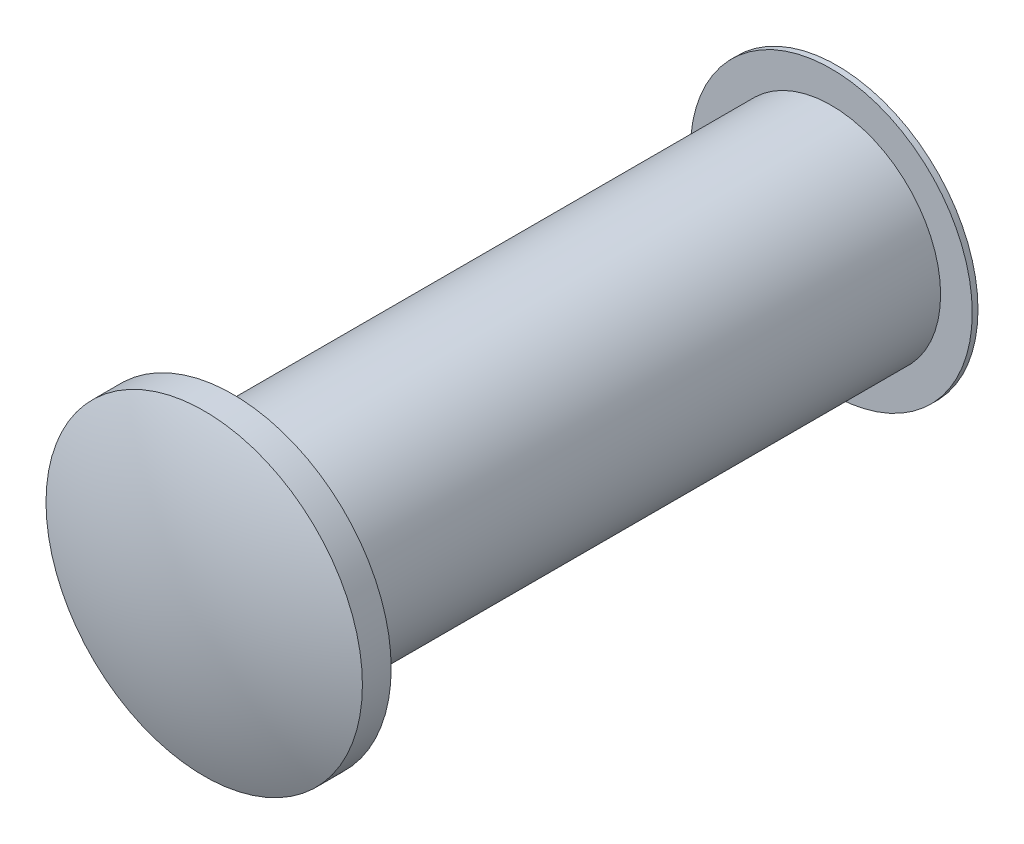
ISO-10303-21;
HEADER;
FILE_DESCRIPTION(('STEP AP214'),'2;1');
FILE_NAME('part.step','',(''),(''),'','','');
FILE_SCHEMA(('AUTOMOTIVE_DESIGN { 1 0 10303 214 1 1 1 1 }'));
ENDSEC;
DATA;
#1=APPLICATION_CONTEXT('core data for automotive mechanical design processes');
#2=APPLICATION_PROTOCOL_DEFINITION('international standard','automotive_design',2000,#1);
#3=PRODUCT_CONTEXT('',#1,'mechanical');
#4=PRODUCT('Part','Part','',(#3));
#5=PRODUCT_RELATED_PRODUCT_CATEGORY('part','',(#4));
#6=PRODUCT_DEFINITION_FORMATION('','',#4);
#7=PRODUCT_DEFINITION_CONTEXT('part definition',#1,'design');
#8=PRODUCT_DEFINITION('design','',#6,#7);
#9=PRODUCT_DEFINITION_SHAPE('','',#8);
#10=(LENGTH_UNIT() NAMED_UNIT(*) SI_UNIT(.MILLI.,.METRE.));
#11=(NAMED_UNIT(*) PLANE_ANGLE_UNIT() SI_UNIT($,.RADIAN.));
#12=(NAMED_UNIT(*) SI_UNIT($,.STERADIAN.) SOLID_ANGLE_UNIT());
#13=UNCERTAINTY_MEASURE_WITH_UNIT(LENGTH_MEASURE(1.E-05),#10,'distance_accuracy_value','');
#14=(GEOMETRIC_REPRESENTATION_CONTEXT(3) GLOBAL_UNCERTAINTY_ASSIGNED_CONTEXT((#13)) GLOBAL_UNIT_ASSIGNED_CONTEXT((#10,
#11,#12)) REPRESENTATION_CONTEXT('',''));
#15=CARTESIAN_POINT('',(0.,0.,0.));
#16=DIRECTION('',(0.,0.,1.));
#17=DIRECTION('',(1.,0.,0.));
#18=AXIS2_PLACEMENT_3D('',#15,#16,#17);
#19=CARTESIAN_POINT('',(0.,0.,5.2832));
#20=DIRECTION('',(0.,0.,-1.));
#21=DIRECTION('',(-1.,0.,0.));
#22=AXIS2_PLACEMENT_3D('',#19,#20,#21);
#23=CYLINDRICAL_SURFACE('',#22,0.9652);
#24=CARTESIAN_POINT('',(0.,0.,5.2832));
#25=DIRECTION('',(0.,0.,1.));
#26=DIRECTION('',(1.,0.,0.));
#27=AXIS2_PLACEMENT_3D('',#24,#25,#26);
#28=CIRCLE('',#27,0.9652);
#29=CARTESIAN_POINT('',(0.9652,0.,5.2832));
#30=VERTEX_POINT('',#29);
#31=EDGE_CURVE('E10',#30,#30,#28,.T.);
#32=ORIENTED_EDGE('',*,*,#31,.F.);
#33=EDGE_LOOP('',(#32));
#34=FACE_BOUND('',#33,.T.);
#35=CARTESIAN_POINT('',(0.,0.,0.));
#36=DIRECTION('',(0.,0.,1.));
#37=DIRECTION('',(1.,0.,0.));
#38=AXIS2_PLACEMENT_3D('',#35,#36,#37);
#39=CIRCLE('',#38,0.9652);
#40=CARTESIAN_POINT('',(0.9652,0.,0.));
#41=VERTEX_POINT('',#40);
#42=EDGE_CURVE('E56',#41,#41,#39,.T.);
#43=ORIENTED_EDGE('',*,*,#42,.T.);
#44=EDGE_LOOP('',(#43));
#45=FACE_BOUND('',#44,.T.);
#46=ADVANCED_FACE('F38',(#34,#45),#23,.T.);
#47=CARTESIAN_POINT('',(0.,0.,5.5372));
#48=DIRECTION('',(0.,0.,-1.));
#49=DIRECTION('',(-1.,0.,0.));
#50=AXIS2_PLACEMENT_3D('',#47,#48,#49);
#51=CYLINDRICAL_SURFACE('',#50,1.397);
#52=CARTESIAN_POINT('',(0.,0.,5.5372));
#53=DIRECTION('',(0.,0.,1.));
#54=DIRECTION('',(1.,0.,0.));
#55=AXIS2_PLACEMENT_3D('',#52,#53,#54);
#56=CIRCLE('',#55,1.397);
#57=CARTESIAN_POINT('',(1.397,0.,5.5372));
#58=VERTEX_POINT('',#57);
#59=EDGE_CURVE('E42',#58,#58,#56,.T.);
#60=ORIENTED_EDGE('',*,*,#59,.F.);
#61=EDGE_LOOP('',(#60));
#62=FACE_BOUND('',#61,.T.);
#63=CARTESIAN_POINT('',(0.,0.,5.2832));
#64=DIRECTION('',(0.,0.,1.));
#65=DIRECTION('',(1.,0.,0.));
#66=AXIS2_PLACEMENT_3D('',#63,#64,#65);
#67=CIRCLE('',#66,1.397);
#68=CARTESIAN_POINT('',(1.397,0.,5.2832));
#69=VERTEX_POINT('',#68);
#70=EDGE_CURVE('E53',#69,#69,#67,.T.);
#71=ORIENTED_EDGE('',*,*,#70,.T.);
#72=EDGE_LOOP('',(#71));
#73=FACE_BOUND('',#72,.T.);
#74=ADVANCED_FACE('F108',(#62,#73),#51,.T.);
#75=CARTESIAN_POINT('',(0.,0.,2.1844));
#76=DIRECTION('',(0.,0.,1.));
#77=DIRECTION('',(1.,0.,0.));
#78=AXIS2_PLACEMENT_3D('',#75,#76,#77);
#79=SPHERICAL_SURFACE('',#78,3.6322);
#80=ORIENTED_EDGE('',*,*,#59,.T.);
#81=EDGE_LOOP('',(#80));
#82=FACE_BOUND('',#81,.T.);
#83=ADVANCED_FACE('F40',(#82),#79,.T.);
#84=CARTESIAN_POINT('',(0.,0.,5.2832));
#85=DIRECTION('',(0.,0.,1.));
#86=DIRECTION('',(1.,0.,0.));
#87=AXIS2_PLACEMENT_3D('',#84,#85,#86);
#88=PLANE('',#87);
#89=ORIENTED_EDGE('',*,*,#31,.T.);
#90=EDGE_LOOP('',(#89));
#91=FACE_BOUND('',#90,.T.);
#92=ORIENTED_EDGE('',*,*,#70,.F.);
#93=EDGE_LOOP('',(#92));
#94=FACE_BOUND('',#93,.T.);
#95=ADVANCED_FACE('F104',(#91,#94),#88,.F.);
#96=CARTESIAN_POINT('',(0.,0.,-0.0507999999999999));
#97=DIRECTION('',(0.,0.,1.));
#98=DIRECTION('',(1.,0.,0.));
#99=AXIS2_PLACEMENT_3D('',#96,#97,#98);
#100=CYLINDRICAL_SURFACE('',#99,1.2446);
#101=CARTESIAN_POINT('',(0.,0.,-0.0507999999999999));
#102=DIRECTION('',(0.,0.,-1.));
#103=DIRECTION('',(-1.,0.,0.));
#104=AXIS2_PLACEMENT_3D('',#101,#102,#103);
#105=CIRCLE('',#104,1.2446);
#106=CARTESIAN_POINT('',(-1.2446,0.,-0.0507999999999999));
#107=VERTEX_POINT('',#106);
#108=EDGE_CURVE('E59',#107,#107,#105,.T.);
#109=ORIENTED_EDGE('',*,*,#108,.F.);
#110=EDGE_LOOP('',(#109));
#111=FACE_BOUND('',#110,.T.);
#112=CARTESIAN_POINT('',(0.,0.,0.));
#113=DIRECTION('',(0.,0.,-1.));
#114=DIRECTION('',(-1.,0.,0.));
#115=AXIS2_PLACEMENT_3D('',#112,#113,#114);
#116=CIRCLE('',#115,1.2446);
#117=CARTESIAN_POINT('',(-1.2446,0.,0.));
#118=VERTEX_POINT('',#117);
#119=EDGE_CURVE('E67',#118,#118,#116,.T.);
#120=ORIENTED_EDGE('',*,*,#119,.T.);
#121=EDGE_LOOP('',(#120));
#122=FACE_BOUND('',#121,.T.);
#123=ADVANCED_FACE('F96',(#111,#122),#100,.T.);
#124=CARTESIAN_POINT('',(0.,0.,-0.0507999999999999));
#125=DIRECTION('',(0.,0.,-1.));
#126=DIRECTION('',(-1.,0.,0.));
#127=AXIS2_PLACEMENT_3D('',#124,#125,#126);
#128=PLANE('',#127);
#129=CARTESIAN_POINT('',(0.,0.,-0.0507999999999999));
#130=DIRECTION('',(0.,0.,-1.));
#131=DIRECTION('',(-1.,0.,0.));
#132=AXIS2_PLACEMENT_3D('',#129,#130,#131);
#133=CIRCLE('',#132,0.592078561156017);
#134=CARTESIAN_POINT('',(-0.592078561156017,0.,-0.0507999999999999));
#135=VERTEX_POINT('',#134);
#136=EDGE_CURVE('E76',#135,#135,#133,.T.);
#137=ORIENTED_EDGE('',*,*,#136,.F.);
#138=EDGE_LOOP('',(#137));
#139=FACE_BOUND('',#138,.T.);
#140=ORIENTED_EDGE('',*,*,#108,.T.);
#141=EDGE_LOOP('',(#140));
#142=FACE_BOUND('',#141,.T.);
#143=ADVANCED_FACE('F94',(#139,#142),#128,.T.);
#144=CARTESIAN_POINT('',(0.,0.,0.));
#145=DIRECTION('',(0.,0.,-1.));
#146=DIRECTION('',(-1.,0.,0.));
#147=AXIS2_PLACEMENT_3D('',#144,#145,#146);
#148=PLANE('',#147);
#149=ORIENTED_EDGE('',*,*,#42,.F.);
#150=EDGE_LOOP('',(#149));
#151=FACE_BOUND('',#150,.T.);
#152=ORIENTED_EDGE('',*,*,#119,.F.);
#153=EDGE_LOOP('',(#152));
#154=FACE_BOUND('',#153,.T.);
#155=ADVANCED_FACE('F90',(#151,#154),#148,.F.);
#156=CARTESIAN_POINT('',(0.,0.,0.4572));
#157=DIRECTION('',(0.,0.,-1.));
#158=DIRECTION('',(-1.,0.,0.));
#159=AXIS2_PLACEMENT_3D('',#156,#157,#158);
#160=CYLINDRICAL_SURFACE('',#159,0.592078561156017);
#161=CARTESIAN_POINT('',(0.,0.,0.4572));
#162=DIRECTION('',(0.,0.,-1.));
#163=DIRECTION('',(-1.,0.,0.));
#164=AXIS2_PLACEMENT_3D('',#161,#162,#163);
#165=CIRCLE('',#164,0.592078561156017);
#166=CARTESIAN_POINT('',(-0.592078561156017,0.,0.4572));
#167=VERTEX_POINT('',#166);
#168=EDGE_CURVE('E74',#167,#167,#165,.T.);
#169=ORIENTED_EDGE('',*,*,#168,.F.);
#170=EDGE_LOOP('',(#169));
#171=FACE_BOUND('',#170,.T.);
#172=ORIENTED_EDGE('',*,*,#136,.T.);
#173=EDGE_LOOP('',(#172));
#174=FACE_BOUND('',#173,.T.);
#175=ADVANCED_FACE('F87',(#171,#174),#160,.F.);
#176=CARTESIAN_POINT('',(0.,0.,0.4572));
#177=DIRECTION('',(0.,0.,-1.));
#178=DIRECTION('',(-1.,0.,0.));
#179=AXIS2_PLACEMENT_3D('',#176,#177,#178);
#180=PLANE('',#179);
#181=ORIENTED_EDGE('',*,*,#168,.T.);
#182=EDGE_LOOP('',(#181));
#183=FACE_BOUND('',#182,.T.);
#184=ADVANCED_FACE('F85',(#183),#180,.T.);
#185=CLOSED_SHELL('',(#46,#74,#83,#95,#123,#143,#155,#175,#184));
#186=MANIFOLD_SOLID_BREP('B2',#185);
#187=ADVANCED_BREP_SHAPE_REPRESENTATION('',(#18,#186),#14);
#188=SHAPE_DEFINITION_REPRESENTATION(#9,#187);
ENDSEC;
END-ISO-10303-21;
